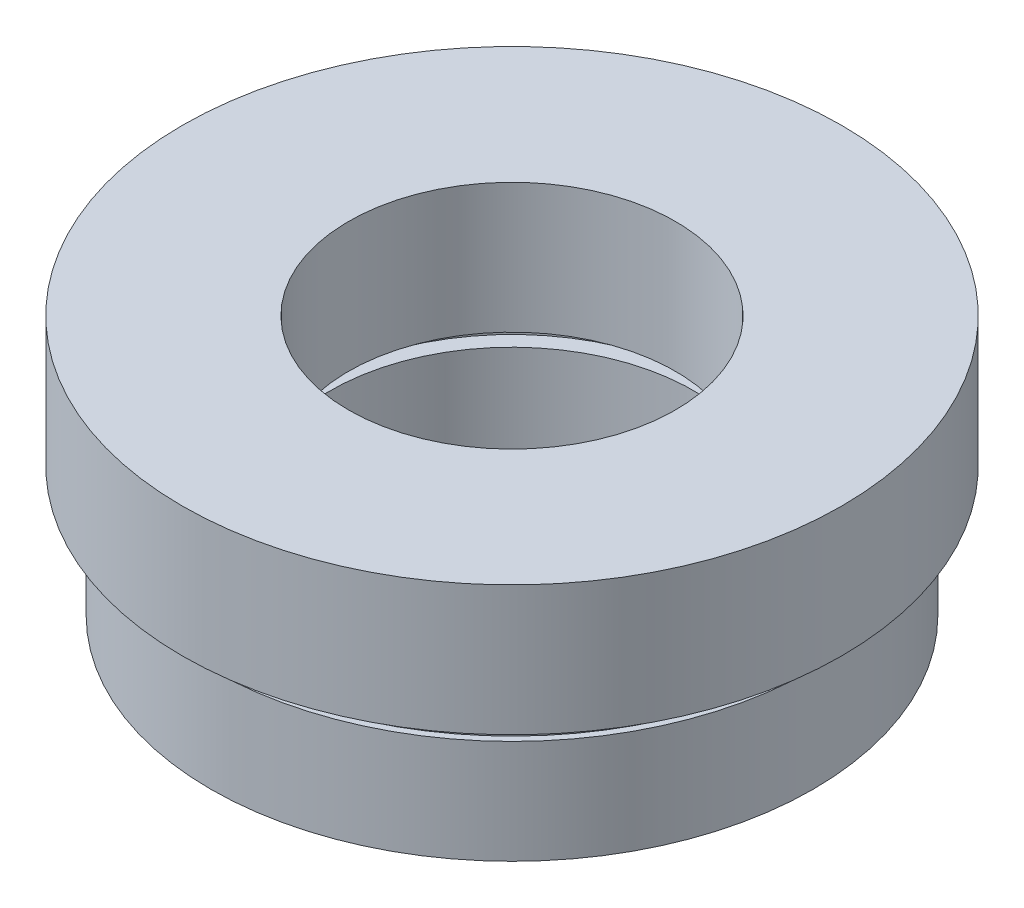
ISO-10303-21;
HEADER;
FILE_DESCRIPTION(('STEP AP214'),'2;1');
FILE_NAME('part.step','',(''),(''),'','','');
FILE_SCHEMA(('AUTOMOTIVE_DESIGN { 1 0 10303 214 1 1 1 1 }'));
ENDSEC;
DATA;
#1=APPLICATION_CONTEXT('core data for automotive mechanical design processes');
#2=APPLICATION_PROTOCOL_DEFINITION('international standard','automotive_design',2000,#1);
#3=PRODUCT_CONTEXT('',#1,'mechanical');
#4=PRODUCT('Part','Part','',(#3));
#5=PRODUCT_RELATED_PRODUCT_CATEGORY('part','',(#4));
#6=PRODUCT_DEFINITION_FORMATION('','',#4);
#7=PRODUCT_DEFINITION_CONTEXT('part definition',#1,'design');
#8=PRODUCT_DEFINITION('design','',#6,#7);
#9=PRODUCT_DEFINITION_SHAPE('','',#8);
#10=(LENGTH_UNIT() NAMED_UNIT(*) SI_UNIT(.MILLI.,.METRE.));
#11=(NAMED_UNIT(*) PLANE_ANGLE_UNIT() SI_UNIT($,.RADIAN.));
#12=(NAMED_UNIT(*) SI_UNIT($,.STERADIAN.) SOLID_ANGLE_UNIT());
#13=UNCERTAINTY_MEASURE_WITH_UNIT(LENGTH_MEASURE(1.E-05),#10,'distance_accuracy_value','');
#14=(GEOMETRIC_REPRESENTATION_CONTEXT(3) GLOBAL_UNCERTAINTY_ASSIGNED_CONTEXT((#13)) GLOBAL_UNIT_ASSIGNED_CONTEXT((#10,
#11,#12)) REPRESENTATION_CONTEXT('',''));
#15=CARTESIAN_POINT('',(0.,0.,0.));
#16=DIRECTION('',(0.,0.,1.));
#17=DIRECTION('',(1.,0.,0.));
#18=AXIS2_PLACEMENT_3D('',#15,#16,#17);
#19=CARTESIAN_POINT('',(0.,13.7446808510638,0.));
#20=DIRECTION('',(0.,1.,0.));
#21=DIRECTION('',(0.,0.,1.));
#22=AXIS2_PLACEMENT_3D('',#19,#20,#21);
#23=CYLINDRICAL_SURFACE('',#22,7.);
#24=CARTESIAN_POINT('',(0.,0.,0.));
#25=DIRECTION('',(0.,1.,0.));
#26=DIRECTION('',(0.,0.,1.));
#27=AXIS2_PLACEMENT_3D('',#24,#25,#26);
#28=CIRCLE('',#27,7.);
#29=CARTESIAN_POINT('',(0.,0.,7.));
#30=VERTEX_POINT('',#29);
#31=EDGE_CURVE('E73',#30,#30,#28,.T.);
#32=ORIENTED_EDGE('',*,*,#31,.F.);
#33=EDGE_LOOP('',(#32));
#34=FACE_BOUND('',#33,.T.);
#35=CARTESIAN_POINT('',(0.,4.,0.));
#36=DIRECTION('',(0.,1.,0.));
#37=DIRECTION('',(0.,0.,1.));
#38=AXIS2_PLACEMENT_3D('',#35,#36,#37);
#39=CIRCLE('',#38,7.);
#40=CARTESIAN_POINT('',(0.,4.,7.));
#41=VERTEX_POINT('',#40);
#42=EDGE_CURVE('E10',#41,#41,#39,.T.);
#43=ORIENTED_EDGE('',*,*,#42,.T.);
#44=EDGE_LOOP('',(#43));
#45=FACE_BOUND('',#44,.T.);
#46=ADVANCED_FACE('F33',(#34,#45),#23,.F.);
#47=CARTESIAN_POINT('',(7.,4.,0.));
#48=DIRECTION('',(0.,-1.,0.));
#49=DIRECTION('',(0.,0.,-1.));
#50=AXIS2_PLACEMENT_3D('',#47,#48,#49);
#51=PLANE('',#50);
#52=ORIENTED_EDGE('',*,*,#42,.F.);
#53=EDGE_LOOP('',(#52));
#54=FACE_BOUND('',#53,.T.);
#55=CARTESIAN_POINT('',(0.,4.,0.));
#56=DIRECTION('',(0.,1.,0.));
#57=DIRECTION('',(0.,0.,1.));
#58=AXIS2_PLACEMENT_3D('',#55,#56,#57);
#59=CIRCLE('',#58,7.6);
#60=CARTESIAN_POINT('',(0.,4.,7.6));
#61=VERTEX_POINT('',#60);
#62=EDGE_CURVE('E39',#61,#61,#59,.T.);
#63=ORIENTED_EDGE('',*,*,#62,.T.);
#64=EDGE_LOOP('',(#63));
#65=FACE_BOUND('',#64,.T.);
#66=ADVANCED_FACE('F80',(#54,#65),#51,.F.);
#67=CARTESIAN_POINT('',(0.,13.7446808510638,0.));
#68=DIRECTION('',(0.,1.,0.));
#69=DIRECTION('',(0.,0.,1.));
#70=AXIS2_PLACEMENT_3D('',#67,#68,#69);
#71=CYLINDRICAL_SURFACE('',#70,7.6);
#72=ORIENTED_EDGE('',*,*,#62,.F.);
#73=EDGE_LOOP('',(#72));
#74=FACE_BOUND('',#73,.T.);
#75=CARTESIAN_POINT('',(0.,5.,0.));
#76=DIRECTION('',(0.,1.,0.));
#77=DIRECTION('',(0.,0.,1.));
#78=AXIS2_PLACEMENT_3D('',#75,#76,#77);
#79=CIRCLE('',#78,7.6);
#80=CARTESIAN_POINT('',(0.,5.,7.6));
#81=VERTEX_POINT('',#80);
#82=EDGE_CURVE('E43',#81,#81,#79,.T.);
#83=ORIENTED_EDGE('',*,*,#82,.T.);
#84=EDGE_LOOP('',(#83));
#85=FACE_BOUND('',#84,.T.);
#86=ADVANCED_FACE('F84',(#74,#85),#71,.F.);
#87=CARTESIAN_POINT('',(7.6,5.,0.));
#88=DIRECTION('',(0.,1.,0.));
#89=DIRECTION('',(0.,0.,1.));
#90=AXIS2_PLACEMENT_3D('',#87,#88,#89);
#91=PLANE('',#90);
#92=ORIENTED_EDGE('',*,*,#82,.F.);
#93=EDGE_LOOP('',(#92));
#94=FACE_BOUND('',#93,.T.);
#95=CARTESIAN_POINT('',(0.,5.,0.));
#96=DIRECTION('',(0.,1.,0.));
#97=DIRECTION('',(0.,0.,1.));
#98=AXIS2_PLACEMENT_3D('',#95,#96,#97);
#99=CIRCLE('',#98,6.295);
#100=CARTESIAN_POINT('',(0.,5.,6.295));
#101=VERTEX_POINT('',#100);
#102=EDGE_CURVE('E47',#101,#101,#99,.T.);
#103=ORIENTED_EDGE('',*,*,#102,.T.);
#104=EDGE_LOOP('',(#103));
#105=FACE_BOUND('',#104,.T.);
#106=ADVANCED_FACE('F89',(#94,#105),#91,.F.);
#107=CARTESIAN_POINT('',(0.,13.7446808510638,0.));
#108=DIRECTION('',(0.,1.,0.));
#109=DIRECTION('',(0.,0.,1.));
#110=AXIS2_PLACEMENT_3D('',#107,#108,#109);
#111=CYLINDRICAL_SURFACE('',#110,6.295);
#112=ORIENTED_EDGE('',*,*,#102,.F.);
#113=EDGE_LOOP('',(#112));
#114=FACE_BOUND('',#113,.T.);
#115=CARTESIAN_POINT('',(0.,10.,0.));
#116=DIRECTION('',(0.,1.,0.));
#117=DIRECTION('',(0.,0.,1.));
#118=AXIS2_PLACEMENT_3D('',#115,#116,#117);
#119=CIRCLE('',#118,6.295);
#120=CARTESIAN_POINT('',(0.,10.,6.295));
#121=VERTEX_POINT('',#120);
#122=EDGE_CURVE('E52',#121,#121,#119,.T.);
#123=ORIENTED_EDGE('',*,*,#122,.T.);
#124=EDGE_LOOP('',(#123));
#125=FACE_BOUND('',#124,.T.);
#126=ADVANCED_FACE('F95',(#114,#125),#111,.F.);
#127=CARTESIAN_POINT('',(6.295,10.,0.));
#128=DIRECTION('',(0.,-1.,0.));
#129=DIRECTION('',(0.,0.,-1.));
#130=AXIS2_PLACEMENT_3D('',#127,#128,#129);
#131=PLANE('',#130);
#132=ORIENTED_EDGE('',*,*,#122,.F.);
#133=EDGE_LOOP('',(#132));
#134=FACE_BOUND('',#133,.T.);
#135=CARTESIAN_POINT('',(0.,10.,0.));
#136=DIRECTION('',(0.,1.,0.));
#137=DIRECTION('',(0.,0.,1.));
#138=AXIS2_PLACEMENT_3D('',#135,#136,#137);
#139=CIRCLE('',#138,12.7);
#140=CARTESIAN_POINT('',(0.,10.,12.7));
#141=VERTEX_POINT('',#140);
#142=EDGE_CURVE('E55',#141,#141,#139,.T.);
#143=ORIENTED_EDGE('',*,*,#142,.T.);
#144=EDGE_LOOP('',(#143));
#145=FACE_BOUND('',#144,.T.);
#146=ADVANCED_FACE('F99',(#134,#145),#131,.F.);
#147=CARTESIAN_POINT('',(0.,13.7446808510638,0.));
#148=DIRECTION('',(0.,1.,0.));
#149=DIRECTION('',(0.,0.,1.));
#150=AXIS2_PLACEMENT_3D('',#147,#148,#149);
#151=CYLINDRICAL_SURFACE('',#150,12.7);
#152=ORIENTED_EDGE('',*,*,#142,.F.);
#153=EDGE_LOOP('',(#152));
#154=FACE_BOUND('',#153,.T.);
#155=CARTESIAN_POINT('',(0.,5.,0.));
#156=DIRECTION('',(0.,1.,0.));
#157=DIRECTION('',(0.,0.,1.));
#158=AXIS2_PLACEMENT_3D('',#155,#156,#157);
#159=CIRCLE('',#158,12.7);
#160=CARTESIAN_POINT('',(0.,5.,12.7));
#161=VERTEX_POINT('',#160);
#162=EDGE_CURVE('E58',#161,#161,#159,.T.);
#163=ORIENTED_EDGE('',*,*,#162,.T.);
#164=EDGE_LOOP('',(#163));
#165=FACE_BOUND('',#164,.T.);
#166=ADVANCED_FACE('F103',(#154,#165),#151,.T.);
#167=CARTESIAN_POINT('',(12.7,5.,0.));
#168=DIRECTION('',(0.,1.,0.));
#169=DIRECTION('',(0.,0.,1.));
#170=AXIS2_PLACEMENT_3D('',#167,#168,#169);
#171=PLANE('',#170);
#172=ORIENTED_EDGE('',*,*,#162,.F.);
#173=EDGE_LOOP('',(#172));
#174=FACE_BOUND('',#173,.T.);
#175=CARTESIAN_POINT('',(0.,5.,0.));
#176=DIRECTION('',(0.,1.,0.));
#177=DIRECTION('',(0.,0.,1.));
#178=AXIS2_PLACEMENT_3D('',#175,#176,#177);
#179=CIRCLE('',#178,11.35);
#180=CARTESIAN_POINT('',(0.,5.,11.35));
#181=VERTEX_POINT('',#180);
#182=EDGE_CURVE('E61',#181,#181,#179,.T.);
#183=ORIENTED_EDGE('',*,*,#182,.T.);
#184=EDGE_LOOP('',(#183));
#185=FACE_BOUND('',#184,.T.);
#186=ADVANCED_FACE('F107',(#174,#185),#171,.F.);
#187=CARTESIAN_POINT('',(0.,13.7446808510638,0.));
#188=DIRECTION('',(0.,1.,0.));
#189=DIRECTION('',(0.,0.,1.));
#190=AXIS2_PLACEMENT_3D('',#187,#188,#189);
#191=CYLINDRICAL_SURFACE('',#190,11.35);
#192=ORIENTED_EDGE('',*,*,#182,.F.);
#193=EDGE_LOOP('',(#192));
#194=FACE_BOUND('',#193,.T.);
#195=CARTESIAN_POINT('',(0.,4.,0.));
#196=DIRECTION('',(0.,1.,0.));
#197=DIRECTION('',(0.,0.,1.));
#198=AXIS2_PLACEMENT_3D('',#195,#196,#197);
#199=CIRCLE('',#198,11.35);
#200=CARTESIAN_POINT('',(0.,4.,11.35));
#201=VERTEX_POINT('',#200);
#202=EDGE_CURVE('E64',#201,#201,#199,.T.);
#203=ORIENTED_EDGE('',*,*,#202,.T.);
#204=EDGE_LOOP('',(#203));
#205=FACE_BOUND('',#204,.T.);
#206=ADVANCED_FACE('F111',(#194,#205),#191,.T.);
#207=CARTESIAN_POINT('',(11.35,4.,0.));
#208=DIRECTION('',(0.,-1.,0.));
#209=DIRECTION('',(0.,0.,-1.));
#210=AXIS2_PLACEMENT_3D('',#207,#208,#209);
#211=PLANE('',#210);
#212=ORIENTED_EDGE('',*,*,#202,.F.);
#213=EDGE_LOOP('',(#212));
#214=FACE_BOUND('',#213,.T.);
#215=CARTESIAN_POINT('',(0.,4.,0.));
#216=DIRECTION('',(0.,1.,0.));
#217=DIRECTION('',(0.,0.,1.));
#218=AXIS2_PLACEMENT_3D('',#215,#216,#217);
#219=CIRCLE('',#218,11.6);
#220=CARTESIAN_POINT('',(0.,4.,11.6));
#221=VERTEX_POINT('',#220);
#222=EDGE_CURVE('E67',#221,#221,#219,.T.);
#223=ORIENTED_EDGE('',*,*,#222,.T.);
#224=EDGE_LOOP('',(#223));
#225=FACE_BOUND('',#224,.T.);
#226=ADVANCED_FACE('F115',(#214,#225),#211,.F.);
#227=CARTESIAN_POINT('',(0.,13.7446808510638,0.));
#228=DIRECTION('',(0.,1.,0.));
#229=DIRECTION('',(0.,0.,1.));
#230=AXIS2_PLACEMENT_3D('',#227,#228,#229);
#231=CYLINDRICAL_SURFACE('',#230,11.6);
#232=ORIENTED_EDGE('',*,*,#222,.F.);
#233=EDGE_LOOP('',(#232));
#234=FACE_BOUND('',#233,.T.);
#235=CARTESIAN_POINT('',(0.,0.,0.));
#236=DIRECTION('',(0.,1.,0.));
#237=DIRECTION('',(0.,0.,1.));
#238=AXIS2_PLACEMENT_3D('',#235,#236,#237);
#239=CIRCLE('',#238,11.6);
#240=CARTESIAN_POINT('',(0.,0.,11.6));
#241=VERTEX_POINT('',#240);
#242=EDGE_CURVE('E70',#241,#241,#239,.T.);
#243=ORIENTED_EDGE('',*,*,#242,.T.);
#244=EDGE_LOOP('',(#243));
#245=FACE_BOUND('',#244,.T.);
#246=ADVANCED_FACE('F119',(#234,#245),#231,.T.);
#247=CARTESIAN_POINT('',(11.6,0.,0.));
#248=DIRECTION('',(0.,1.,0.));
#249=DIRECTION('',(0.,0.,1.));
#250=AXIS2_PLACEMENT_3D('',#247,#248,#249);
#251=PLANE('',#250);
#252=ORIENTED_EDGE('',*,*,#242,.F.);
#253=EDGE_LOOP('',(#252));
#254=FACE_BOUND('',#253,.T.);
#255=ORIENTED_EDGE('',*,*,#31,.T.);
#256=EDGE_LOOP('',(#255));
#257=FACE_BOUND('',#256,.T.);
#258=ADVANCED_FACE('F77',(#254,#257),#251,.F.);
#259=CLOSED_SHELL('',(#46,#66,#86,#106,#126,#146,#166,#186,#206,#226,#246,#258));
#260=MANIFOLD_SOLID_BREP('B2',#259);
#261=ADVANCED_BREP_SHAPE_REPRESENTATION('',(#18,#260),#14);
#262=SHAPE_DEFINITION_REPRESENTATION(#9,#261);
ENDSEC;
END-ISO-10303-21;
